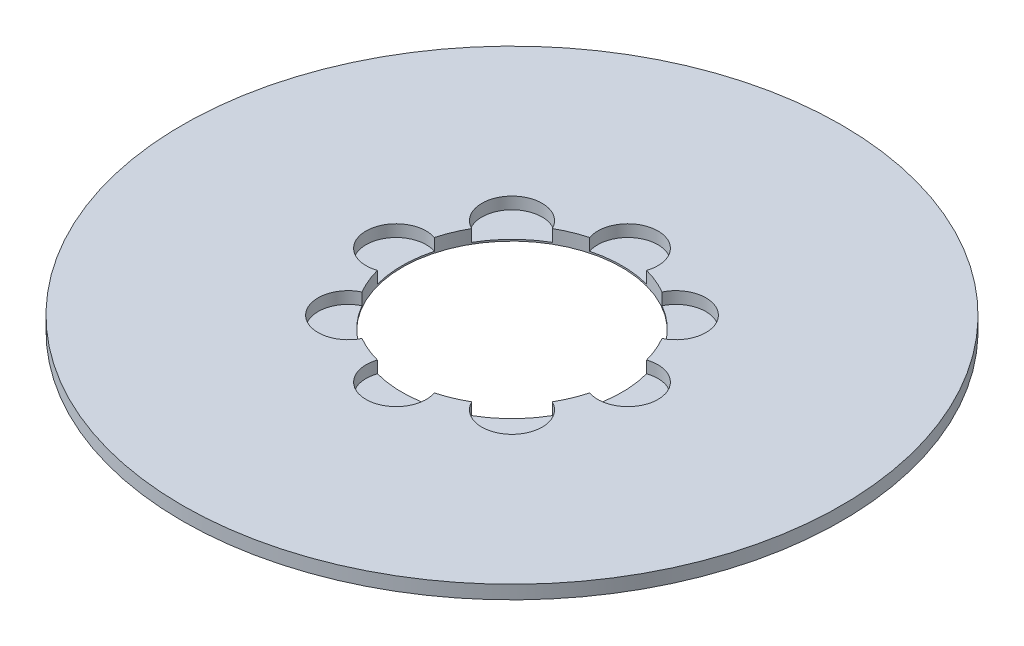
ISO-10303-21;
HEADER;
FILE_DESCRIPTION(('STEP AP214'),'2;1');
FILE_NAME('part.step','',(''),(''),'','','');
FILE_SCHEMA(('AUTOMOTIVE_DESIGN { 1 0 10303 214 1 1 1 1 }'));
ENDSEC;
DATA;
#1=APPLICATION_CONTEXT('core data for automotive mechanical design processes');
#2=APPLICATION_PROTOCOL_DEFINITION('international standard','automotive_design',2000,#1);
#3=PRODUCT_CONTEXT('',#1,'mechanical');
#4=PRODUCT('Part','Part','',(#3));
#5=PRODUCT_RELATED_PRODUCT_CATEGORY('part','',(#4));
#6=PRODUCT_DEFINITION_FORMATION('','',#4);
#7=PRODUCT_DEFINITION_CONTEXT('part definition',#1,'design');
#8=PRODUCT_DEFINITION('design','',#6,#7);
#9=PRODUCT_DEFINITION_SHAPE('','',#8);
#10=(LENGTH_UNIT() NAMED_UNIT(*) SI_UNIT(.MILLI.,.METRE.));
#11=(NAMED_UNIT(*) PLANE_ANGLE_UNIT() SI_UNIT($,.RADIAN.));
#12=(NAMED_UNIT(*) SI_UNIT($,.STERADIAN.) SOLID_ANGLE_UNIT());
#13=UNCERTAINTY_MEASURE_WITH_UNIT(LENGTH_MEASURE(1.E-05),#10,'distance_accuracy_value','');
#14=(GEOMETRIC_REPRESENTATION_CONTEXT(3) GLOBAL_UNCERTAINTY_ASSIGNED_CONTEXT((#13)) GLOBAL_UNIT_ASSIGNED_CONTEXT((#10,
#11,#12)) REPRESENTATION_CONTEXT('',''));
#15=CARTESIAN_POINT('',(0.,0.,0.));
#16=DIRECTION('',(0.,0.,1.));
#17=DIRECTION('',(1.,0.,0.));
#18=AXIS2_PLACEMENT_3D('',#15,#16,#17);
#19=CARTESIAN_POINT('',(0.,4.,0.));
#20=DIRECTION('',(0.,-1.,0.));
#21=DIRECTION('',(0.,0.,-1.));
#22=AXIS2_PLACEMENT_3D('',#19,#20,#21);
#23=CYLINDRICAL_SURFACE('',#22,97.5);
#24=CARTESIAN_POINT('',(0.,4.,0.));
#25=DIRECTION('',(0.,1.,0.));
#26=DIRECTION('',(0.,0.,1.));
#27=AXIS2_PLACEMENT_3D('',#24,#25,#26);
#28=CIRCLE('',#27,97.5);
#29=CARTESIAN_POINT('',(0.,4.,97.5));
#30=VERTEX_POINT('',#29);
#31=EDGE_CURVE('E195',#30,#30,#28,.T.);
#32=ORIENTED_EDGE('',*,*,#31,.F.);
#33=EDGE_LOOP('',(#32));
#34=FACE_BOUND('',#33,.T.);
#35=CARTESIAN_POINT('',(0.,0.,0.));
#36=DIRECTION('',(0.,1.,0.));
#37=DIRECTION('',(0.,0.,1.));
#38=AXIS2_PLACEMENT_3D('',#35,#36,#37);
#39=CIRCLE('',#38,97.5);
#40=CARTESIAN_POINT('',(0.,0.,97.5));
#41=VERTEX_POINT('',#40);
#42=EDGE_CURVE('E179',#41,#41,#39,.T.);
#43=ORIENTED_EDGE('',*,*,#42,.T.);
#44=EDGE_LOOP('',(#43));
#45=FACE_BOUND('',#44,.T.);
#46=ADVANCED_FACE('F39',(#34,#45),#23,.T.);
#47=CARTESIAN_POINT('',(0.,4.,0.));
#48=DIRECTION('',(0.,1.,0.));
#49=DIRECTION('',(0.,0.,1.));
#50=AXIS2_PLACEMENT_3D('',#47,#48,#49);
#51=PLANE('',#50);
#52=CARTESIAN_POINT('',(1.19679199415375E-13,4.,34.2774850559646));
#53=DIRECTION('',(0.,1.,0.));
#54=DIRECTION('',(1.,0.,0.));
#55=AXIS2_PLACEMENT_3D('',#52,#53,#54);
#56=CIRCLE('',#55,8.90529188802286);
#57=CARTESIAN_POINT('',(-8.42392700702646,4.,31.3892888383966));
#58=VERTEX_POINT('',#57);
#59=CARTESIAN_POINT('',(8.42392700702668,4.,31.3892888383966));
#60=VERTEX_POINT('',#59);
#61=EDGE_CURVE('E176',#58,#60,#56,.T.);
#62=ORIENTED_EDGE('',*,*,#61,.F.);
#63=CARTESIAN_POINT('',(0.,4.,0.));
#64=DIRECTION('',(0.,1.,0.));
#65=DIRECTION('',(0.,0.,1.));
#66=AXIS2_PLACEMENT_3D('',#63,#64,#65);
#67=CIRCLE('',#66,32.5);
#68=CARTESIAN_POINT('',(-16.2389630833644,4.,28.1521949051425));
#69=VERTEX_POINT('',#68);
#70=EDGE_CURVE('E166',#69,#58,#67,.T.);
#71=ORIENTED_EDGE('',*,*,#70,.F.);
#72=CARTESIAN_POINT('',(-24.2378421250931,4.,24.2378421250931));
#73=DIRECTION('',(0.,1.,0.));
#74=DIRECTION('',(0.707106781186549,0.,0.707106781186546));
#75=AXIS2_PLACEMENT_3D('',#72,#73,#74);
#76=CIRCLE('',#75,8.90529188802286);
#77=CARTESIAN_POINT('',(-28.1521949051424,4.,16.2389630833645));
#78=VERTEX_POINT('',#77);
#79=EDGE_CURVE('E147',#78,#69,#76,.T.);
#80=ORIENTED_EDGE('',*,*,#79,.F.);
#81=CARTESIAN_POINT('',(-31.3892888383966,4.,8.42392700702657));
#82=VERTEX_POINT('',#81);
#83=EDGE_CURVE('E180',#82,#78,#67,.T.);
#84=ORIENTED_EDGE('',*,*,#83,.F.);
#85=CARTESIAN_POINT('',(-34.2774850559646,4.,0.));
#86=DIRECTION('',(0.,1.,0.));
#87=DIRECTION('',(0.,0.,1.));
#88=AXIS2_PLACEMENT_3D('',#85,#86,#87);
#89=CIRCLE('',#88,8.90529188802286);
#90=CARTESIAN_POINT('',(-31.3892888383966,4.,-8.42392700702657));
#91=VERTEX_POINT('',#90);
#92=EDGE_CURVE('E186',#91,#82,#89,.T.);
#93=ORIENTED_EDGE('',*,*,#92,.F.);
#94=CARTESIAN_POINT('',(-28.1521949051426,4.,-16.2389630833641));
#95=VERTEX_POINT('',#94);
#96=EDGE_CURVE('E182',#95,#91,#67,.T.);
#97=ORIENTED_EDGE('',*,*,#96,.F.);
#98=CARTESIAN_POINT('',(-24.2378421250934,4.,-24.2378421250928));
#99=DIRECTION('',(0.,1.,0.));
#100=DIRECTION('',(-0.707106781186539,0.,0.707106781186556));
#101=AXIS2_PLACEMENT_3D('',#98,#99,#100);
#102=CIRCLE('',#101,8.90529188802286);
#103=CARTESIAN_POINT('',(-16.2389630833648,4.,-28.1521949051422));
#104=VERTEX_POINT('',#103);
#105=EDGE_CURVE('E446',#104,#95,#102,.T.);
#106=ORIENTED_EDGE('',*,*,#105,.F.);
#107=CARTESIAN_POINT('',(-8.4239270070269,4.,-31.3892888383965));
#108=VERTEX_POINT('',#107);
#109=EDGE_CURVE('E452',#108,#104,#67,.T.);
#110=ORIENTED_EDGE('',*,*,#109,.F.);
#111=CARTESIAN_POINT('',(-3.59037598246124E-13,4.,-34.2774850559646));
#112=DIRECTION('',(0.,1.,0.));
#113=DIRECTION('',(-1.,0.,0.));
#114=AXIS2_PLACEMENT_3D('',#111,#112,#113);
#115=CIRCLE('',#114,8.90529188802286);
#116=CARTESIAN_POINT('',(8.42392700702624,4.,-31.3892888383967));
#117=VERTEX_POINT('',#116);
#118=EDGE_CURVE('E477',#117,#108,#115,.T.);
#119=ORIENTED_EDGE('',*,*,#118,.F.);
#120=CARTESIAN_POINT('',(16.2389630833642,4.,-28.1521949051426));
#121=VERTEX_POINT('',#120);
#122=EDGE_CURVE('E460',#121,#117,#67,.T.);
#123=ORIENTED_EDGE('',*,*,#122,.F.);
#124=CARTESIAN_POINT('',(24.2378421250929,4.,-24.2378421250933));
#125=DIRECTION('',(0.,1.,0.));
#126=DIRECTION('',(-0.707106781186554,0.,-0.707106781186541));
#127=AXIS2_PLACEMENT_3D('',#124,#125,#126);
#128=CIRCLE('',#127,8.90529188802286);
#129=CARTESIAN_POINT('',(28.1521949051423,4.,-16.2389630833647));
#130=VERTEX_POINT('',#129);
#131=EDGE_CURVE('E464',#130,#121,#128,.T.);
#132=ORIENTED_EDGE('',*,*,#131,.F.);
#133=CARTESIAN_POINT('',(31.3892888383966,4.,-8.42392700702657));
#134=VERTEX_POINT('',#133);
#135=EDGE_CURVE('E459',#134,#130,#67,.T.);
#136=ORIENTED_EDGE('',*,*,#135,.F.);
#137=CARTESIAN_POINT('',(34.2774850559646,4.,0.));
#138=DIRECTION('',(0.,1.,0.));
#139=DIRECTION('',(0.,0.,-1.));
#140=AXIS2_PLACEMENT_3D('',#137,#138,#139);
#141=CIRCLE('',#140,8.90529188802286);
#142=CARTESIAN_POINT('',(31.3892888383966,4.,8.42392700702657));
#143=VERTEX_POINT('',#142);
#144=EDGE_CURVE('E469',#143,#134,#141,.T.);
#145=ORIENTED_EDGE('',*,*,#144,.F.);
#146=CARTESIAN_POINT('',(28.1521949051425,4.,16.2389630833643));
#147=VERTEX_POINT('',#146);
#148=EDGE_CURVE('E181',#147,#143,#67,.T.);
#149=ORIENTED_EDGE('',*,*,#148,.F.);
#150=CARTESIAN_POINT('',(24.2378421250932,4.,24.237842125093));
#151=DIRECTION('',(0.,1.,0.));
#152=DIRECTION('',(0.707106781186544,0.,-0.707106781186551));
#153=AXIS2_PLACEMENT_3D('',#150,#151,#152);
#154=CIRCLE('',#153,8.90529188802286);
#155=CARTESIAN_POINT('',(16.2389630833646,4.,28.1521949051423));
#156=VERTEX_POINT('',#155);
#157=EDGE_CURVE('E475',#156,#147,#154,.T.);
#158=ORIENTED_EDGE('',*,*,#157,.F.);
#159=EDGE_CURVE('E177',#60,#156,#67,.T.);
#160=ORIENTED_EDGE('',*,*,#159,.F.);
#161=EDGE_LOOP('',(#62,#71,#80,#84,#93,#97,#106,#110,#119,#123,#132,#136,#145,#149,#158,#160));
#162=FACE_BOUND('',#161,.T.);
#163=ORIENTED_EDGE('',*,*,#31,.T.);
#164=EDGE_LOOP('',(#163));
#165=FACE_BOUND('',#164,.T.);
#166=ADVANCED_FACE('F172',(#162,#165),#51,.T.);
#167=CARTESIAN_POINT('',(0.,0.,0.));
#168=DIRECTION('',(0.,1.,0.));
#169=DIRECTION('',(0.,0.,1.));
#170=AXIS2_PLACEMENT_3D('',#167,#168,#169);
#171=PLANE('',#170);
#172=CARTESIAN_POINT('',(0.,0.,0.));
#173=DIRECTION('',(0.,1.,0.));
#174=DIRECTION('',(0.,0.,1.));
#175=AXIS2_PLACEMENT_3D('',#172,#173,#174);
#176=CIRCLE('',#175,32.5);
#177=CARTESIAN_POINT('',(0.,0.,32.5));
#178=VERTEX_POINT('',#177);
#179=EDGE_CURVE('E187',#178,#178,#176,.T.);
#180=ORIENTED_EDGE('',*,*,#179,.T.);
#181=EDGE_LOOP('',(#180));
#182=FACE_BOUND('',#181,.T.);
#183=ORIENTED_EDGE('',*,*,#42,.F.);
#184=EDGE_LOOP('',(#183));
#185=FACE_BOUND('',#184,.T.);
#186=ADVANCED_FACE('F270',(#182,#185),#171,.F.);
#187=CARTESIAN_POINT('',(0.,4.,0.));
#188=DIRECTION('',(0.,-1.,0.));
#189=DIRECTION('',(0.,0.,-1.));
#190=AXIS2_PLACEMENT_3D('',#187,#188,#189);
#191=CYLINDRICAL_SURFACE('',#190,32.5);
#192=DIRECTION('',(0.,1.,0.));
#193=VECTOR('',#192,1.);
#194=CARTESIAN_POINT('',(-8.42392700702646,2.23433585870761,31.3892888383966));
#195=LINE('',#194,#193);
#196=CARTESIAN_POINT('',(-8.42392700702646,0.468671717415213,31.3892888383966));
#197=VERTEX_POINT('',#196);
#198=EDGE_CURVE('E11',#197,#58,#195,.T.);
#199=ORIENTED_EDGE('',*,*,#198,.F.);
#200=CARTESIAN_POINT('',(0.,0.468671717415213,0.));
#201=DIRECTION('',(0.,1.,0.));
#202=DIRECTION('',(0.,0.,1.));
#203=AXIS2_PLACEMENT_3D('',#200,#201,#202);
#204=CIRCLE('',#203,32.5);
#205=CARTESIAN_POINT('',(8.42392700702668,0.468671717415213,31.3892888383966));
#206=VERTEX_POINT('',#205);
#207=EDGE_CURVE('E250',#197,#206,#204,.T.);
#208=ORIENTED_EDGE('',*,*,#207,.T.);
#209=DIRECTION('',(0.,1.,0.));
#210=VECTOR('',#209,1.);
#211=CARTESIAN_POINT('',(8.42392700702668,2.23433585870761,31.3892888383965));
#212=LINE('',#211,#210);
#213=EDGE_CURVE('E46',#60,#206,#212,.F.);
#214=ORIENTED_EDGE('',*,*,#213,.F.);
#215=ORIENTED_EDGE('',*,*,#159,.T.);
#216=DIRECTION('',(0.,1.,0.));
#217=VECTOR('',#216,1.);
#218=CARTESIAN_POINT('',(16.2389630833646,2.23433585870761,28.1521949051423));
#219=LINE('',#218,#217);
#220=CARTESIAN_POINT('',(16.2389630833646,0.468671717415213,28.1521949051423));
#221=VERTEX_POINT('',#220);
#222=EDGE_CURVE('E244',#221,#156,#219,.T.);
#223=ORIENTED_EDGE('',*,*,#222,.F.);
#224=CARTESIAN_POINT('',(0.,0.468671717415213,0.));
#225=DIRECTION('',(0.,1.,0.));
#226=DIRECTION('',(0.,0.,1.));
#227=AXIS2_PLACEMENT_3D('',#224,#225,#226);
#228=CIRCLE('',#227,32.5);
#229=CARTESIAN_POINT('',(28.1521949051425,0.468671717415213,16.2389630833643));
#230=VERTEX_POINT('',#229);
#231=EDGE_CURVE('E238',#221,#230,#228,.T.);
#232=ORIENTED_EDGE('',*,*,#231,.T.);
#233=DIRECTION('',(0.,1.,0.));
#234=VECTOR('',#233,1.);
#235=CARTESIAN_POINT('',(28.1521949051425,2.23433585870761,16.2389630833643));
#236=LINE('',#235,#234);
#237=EDGE_CURVE('E242',#147,#230,#236,.F.);
#238=ORIENTED_EDGE('',*,*,#237,.F.);
#239=ORIENTED_EDGE('',*,*,#148,.T.);
#240=DIRECTION('',(0.,1.,0.));
#241=VECTOR('',#240,1.);
#242=CARTESIAN_POINT('',(31.3892888383966,2.23433585870761,8.42392700702657));
#243=LINE('',#242,#241);
#244=CARTESIAN_POINT('',(31.3892888383966,0.468671717415213,8.42392700702657));
#245=VERTEX_POINT('',#244);
#246=EDGE_CURVE('E236',#245,#143,#243,.T.);
#247=ORIENTED_EDGE('',*,*,#246,.F.);
#248=CARTESIAN_POINT('',(0.,0.468671717415213,0.));
#249=DIRECTION('',(0.,1.,0.));
#250=DIRECTION('',(0.,0.,1.));
#251=AXIS2_PLACEMENT_3D('',#248,#249,#250);
#252=CIRCLE('',#251,32.5);
#253=CARTESIAN_POINT('',(31.3892888383966,0.468671717415213,-8.42392700702657));
#254=VERTEX_POINT('',#253);
#255=EDGE_CURVE('E235',#245,#254,#252,.T.);
#256=ORIENTED_EDGE('',*,*,#255,.T.);
#257=DIRECTION('',(0.,1.,0.));
#258=VECTOR('',#257,1.);
#259=CARTESIAN_POINT('',(31.3892888383966,2.23433585870761,-8.42392700702657));
#260=LINE('',#259,#258);
#261=EDGE_CURVE('E234',#134,#254,#260,.F.);
#262=ORIENTED_EDGE('',*,*,#261,.F.);
#263=ORIENTED_EDGE('',*,*,#135,.T.);
#264=DIRECTION('',(0.,1.,0.));
#265=VECTOR('',#264,1.);
#266=CARTESIAN_POINT('',(28.1521949051423,2.23433585870761,-16.2389630833647));
#267=LINE('',#266,#265);
#268=CARTESIAN_POINT('',(28.1521949051423,0.468671717415213,-16.2389630833647));
#269=VERTEX_POINT('',#268);
#270=EDGE_CURVE('E229',#269,#130,#267,.T.);
#271=ORIENTED_EDGE('',*,*,#270,.F.);
#272=CARTESIAN_POINT('',(0.,0.468671717415213,0.));
#273=DIRECTION('',(0.,1.,0.));
#274=DIRECTION('',(0.,0.,1.));
#275=AXIS2_PLACEMENT_3D('',#272,#273,#274);
#276=CIRCLE('',#275,32.5);
#277=CARTESIAN_POINT('',(16.2389630833642,0.468671717415213,-28.1521949051426));
#278=VERTEX_POINT('',#277);
#279=EDGE_CURVE('E221',#269,#278,#276,.T.);
#280=ORIENTED_EDGE('',*,*,#279,.T.);
#281=DIRECTION('',(0.,1.,0.));
#282=VECTOR('',#281,1.);
#283=CARTESIAN_POINT('',(16.2389630833642,2.23433585870761,-28.1521949051426));
#284=LINE('',#283,#282);
#285=EDGE_CURVE('E230',#121,#278,#284,.F.);
#286=ORIENTED_EDGE('',*,*,#285,.F.);
#287=ORIENTED_EDGE('',*,*,#122,.T.);
#288=DIRECTION('',(0.,1.,0.));
#289=VECTOR('',#288,1.);
#290=CARTESIAN_POINT('',(8.42392700702624,2.23433585870761,-31.3892888383967));
#291=LINE('',#290,#289);
#292=CARTESIAN_POINT('',(8.42392700702624,0.468671717415213,-31.3892888383967));
#293=VERTEX_POINT('',#292);
#294=EDGE_CURVE('E225',#293,#117,#291,.T.);
#295=ORIENTED_EDGE('',*,*,#294,.F.);
#296=CARTESIAN_POINT('',(0.,0.468671717415213,0.));
#297=DIRECTION('',(0.,1.,0.));
#298=DIRECTION('',(0.,0.,1.));
#299=AXIS2_PLACEMENT_3D('',#296,#297,#298);
#300=CIRCLE('',#299,32.5);
#301=CARTESIAN_POINT('',(-8.4239270070269,0.468671717415213,-31.3892888383965));
#302=VERTEX_POINT('',#301);
#303=EDGE_CURVE('E216',#293,#302,#300,.T.);
#304=ORIENTED_EDGE('',*,*,#303,.T.);
#305=DIRECTION('',(0.,1.,0.));
#306=VECTOR('',#305,1.);
#307=CARTESIAN_POINT('',(-8.4239270070269,2.23433585870761,-31.3892888383965));
#308=LINE('',#307,#306);
#309=EDGE_CURVE('E218',#108,#302,#308,.F.);
#310=ORIENTED_EDGE('',*,*,#309,.F.);
#311=ORIENTED_EDGE('',*,*,#109,.T.);
#312=DIRECTION('',(0.,1.,0.));
#313=VECTOR('',#312,1.);
#314=CARTESIAN_POINT('',(-16.2389630833648,2.23433585870761,-28.1521949051422));
#315=LINE('',#314,#313);
#316=CARTESIAN_POINT('',(-16.2389630833648,0.468671717415213,-28.1521949051422));
#317=VERTEX_POINT('',#316);
#318=EDGE_CURVE('E212',#317,#104,#315,.T.);
#319=ORIENTED_EDGE('',*,*,#318,.F.);
#320=CARTESIAN_POINT('',(0.,0.468671717415213,0.));
#321=DIRECTION('',(0.,1.,0.));
#322=DIRECTION('',(0.,0.,1.));
#323=AXIS2_PLACEMENT_3D('',#320,#321,#322);
#324=CIRCLE('',#323,32.5);
#325=CARTESIAN_POINT('',(-28.1521949051426,0.468671717415213,-16.2389630833641));
#326=VERTEX_POINT('',#325);
#327=EDGE_CURVE('E208',#317,#326,#324,.T.);
#328=ORIENTED_EDGE('',*,*,#327,.T.);
#329=DIRECTION('',(0.,1.,0.));
#330=VECTOR('',#329,1.);
#331=CARTESIAN_POINT('',(-28.1521949051426,2.23433585870761,-16.2389630833641));
#332=LINE('',#331,#330);
#333=EDGE_CURVE('E211',#95,#326,#332,.F.);
#334=ORIENTED_EDGE('',*,*,#333,.F.);
#335=ORIENTED_EDGE('',*,*,#96,.T.);
#336=DIRECTION('',(0.,1.,0.));
#337=VECTOR('',#336,1.);
#338=CARTESIAN_POINT('',(-31.3892888383966,2.23433585870761,-8.42392700702657));
#339=LINE('',#338,#337);
#340=CARTESIAN_POINT('',(-31.3892888383966,0.468671717415213,-8.42392700702657));
#341=VERTEX_POINT('',#340);
#342=EDGE_CURVE('E201',#341,#91,#339,.T.);
#343=ORIENTED_EDGE('',*,*,#342,.F.);
#344=CARTESIAN_POINT('',(0.,0.468671717415213,0.));
#345=DIRECTION('',(0.,1.,0.));
#346=DIRECTION('',(0.,0.,1.));
#347=AXIS2_PLACEMENT_3D('',#344,#345,#346);
#348=CIRCLE('',#347,32.5);
#349=CARTESIAN_POINT('',(-31.3892888383966,0.468671717415213,8.42392700702657));
#350=VERTEX_POINT('',#349);
#351=EDGE_CURVE('E194',#341,#350,#348,.T.);
#352=ORIENTED_EDGE('',*,*,#351,.T.);
#353=DIRECTION('',(0.,1.,0.));
#354=VECTOR('',#353,1.);
#355=CARTESIAN_POINT('',(-31.3892888383966,2.23433585870761,8.42392700702657));
#356=LINE('',#355,#354);
#357=EDGE_CURVE('E199',#82,#350,#356,.F.);
#358=ORIENTED_EDGE('',*,*,#357,.F.);
#359=ORIENTED_EDGE('',*,*,#83,.T.);
#360=DIRECTION('',(0.,1.,0.));
#361=VECTOR('',#360,1.);
#362=CARTESIAN_POINT('',(-28.1521949051424,2.23433585870761,16.2389630833645));
#363=LINE('',#362,#361);
#364=CARTESIAN_POINT('',(-28.1521949051424,0.468671717415213,16.2389630833645));
#365=VERTEX_POINT('',#364);
#366=EDGE_CURVE('E160',#365,#78,#363,.T.);
#367=ORIENTED_EDGE('',*,*,#366,.F.);
#368=CARTESIAN_POINT('',(0.,0.468671717415213,0.));
#369=DIRECTION('',(0.,1.,0.));
#370=DIRECTION('',(0.,0.,1.));
#371=AXIS2_PLACEMENT_3D('',#368,#369,#370);
#372=CIRCLE('',#371,32.5);
#373=CARTESIAN_POINT('',(-16.2389630833644,0.468671717415213,28.1521949051425));
#374=VERTEX_POINT('',#373);
#375=EDGE_CURVE('E168',#365,#374,#372,.T.);
#376=ORIENTED_EDGE('',*,*,#375,.T.);
#377=DIRECTION('',(0.,1.,0.));
#378=VECTOR('',#377,1.);
#379=CARTESIAN_POINT('',(-16.2389630833644,2.23433585870761,28.1521949051424));
#380=LINE('',#379,#378);
#381=EDGE_CURVE('E152',#69,#374,#380,.F.);
#382=ORIENTED_EDGE('',*,*,#381,.F.);
#383=ORIENTED_EDGE('',*,*,#70,.T.);
#384=EDGE_LOOP('',(#199,#208,#214,#215,#223,#232,#238,#239,#247,#256,#262,#263,#271,#280,#286,
#287,#295,#304,#310,#311,#319,#328,#334,#335,#343,#352,#358,#359,#367,#376,#382,#383));
#385=FACE_BOUND('',#384,.T.);
#386=ORIENTED_EDGE('',*,*,#179,.F.);
#387=EDGE_LOOP('',(#386));
#388=FACE_BOUND('',#387,.T.);
#389=ADVANCED_FACE('F170',(#385,#388),#191,.F.);
#390=CARTESIAN_POINT('',(-34.2774850559646,0.468671717415213,0.));
#391=DIRECTION('',(0.,1.,0.));
#392=DIRECTION('',(0.,0.,1.));
#393=AXIS2_PLACEMENT_3D('',#390,#391,#392);
#394=CYLINDRICAL_SURFACE('',#393,8.90529188802286);
#395=ORIENTED_EDGE('',*,*,#342,.T.);
#396=ORIENTED_EDGE('',*,*,#92,.T.);
#397=ORIENTED_EDGE('',*,*,#357,.T.);
#398=CARTESIAN_POINT('',(-34.2774850559646,0.468671717415213,0.));
#399=DIRECTION('',(0.,1.,0.));
#400=DIRECTION('',(0.,0.,1.));
#401=AXIS2_PLACEMENT_3D('',#398,#399,#400);
#402=CIRCLE('',#401,8.90529188802286);
#403=EDGE_CURVE('E191',#341,#350,#402,.T.);
#404=ORIENTED_EDGE('',*,*,#403,.F.);
#405=EDGE_LOOP('',(#395,#396,#397,#404));
#406=FACE_BOUND('',#405,.T.);
#407=ADVANCED_FACE('F279',(#406),#394,.F.);
#408=CARTESIAN_POINT('',(-34.2774850559646,0.468671717415213,0.));
#409=DIRECTION('',(0.,1.,0.));
#410=DIRECTION('',(0.,0.,1.));
#411=AXIS2_PLACEMENT_3D('',#408,#409,#410);
#412=PLANE('',#411);
#413=ORIENTED_EDGE('',*,*,#403,.T.);
#414=ORIENTED_EDGE('',*,*,#351,.F.);
#415=EDGE_LOOP('',(#413,#414));
#416=FACE_BOUND('',#415,.T.);
#417=ADVANCED_FACE('F285',(#416),#412,.T.);
#418=CARTESIAN_POINT('',(-24.2378421250931,0.468671717415213,24.2378421250931));
#419=DIRECTION('',(0.,1.,0.));
#420=DIRECTION('',(0.,0.,1.));
#421=AXIS2_PLACEMENT_3D('',#418,#419,#420);
#422=CYLINDRICAL_SURFACE('',#421,8.90529188802286);
#423=ORIENTED_EDGE('',*,*,#366,.T.);
#424=ORIENTED_EDGE('',*,*,#79,.T.);
#425=ORIENTED_EDGE('',*,*,#381,.T.);
#426=CARTESIAN_POINT('',(-24.2378421250931,0.468671717415213,24.2378421250931));
#427=DIRECTION('',(0.,1.,0.));
#428=DIRECTION('',(0.707106781186549,0.,0.707106781186546));
#429=AXIS2_PLACEMENT_3D('',#426,#427,#428);
#430=CIRCLE('',#429,8.90529188802286);
#431=EDGE_CURVE('E165',#365,#374,#430,.T.);
#432=ORIENTED_EDGE('',*,*,#431,.F.);
#433=EDGE_LOOP('',(#423,#424,#425,#432));
#434=FACE_BOUND('',#433,.T.);
#435=ADVANCED_FACE('F155',(#434),#422,.F.);
#436=CARTESIAN_POINT('',(-24.2378421250931,0.468671717415213,24.2378421250931));
#437=DIRECTION('',(0.,1.,0.));
#438=DIRECTION('',(0.707106781186549,0.,0.707106781186546));
#439=AXIS2_PLACEMENT_3D('',#436,#437,#438);
#440=PLANE('',#439);
#441=ORIENTED_EDGE('',*,*,#431,.T.);
#442=ORIENTED_EDGE('',*,*,#375,.F.);
#443=EDGE_LOOP('',(#441,#442));
#444=FACE_BOUND('',#443,.T.);
#445=ADVANCED_FACE('F288',(#444),#440,.T.);
#446=CARTESIAN_POINT('',(-24.2378421250934,0.468671717415213,-24.2378421250928));
#447=DIRECTION('',(0.,1.,0.));
#448=DIRECTION('',(0.,0.,1.));
#449=AXIS2_PLACEMENT_3D('',#446,#447,#448);
#450=CYLINDRICAL_SURFACE('',#449,8.90529188802286);
#451=ORIENTED_EDGE('',*,*,#318,.T.);
#452=ORIENTED_EDGE('',*,*,#105,.T.);
#453=ORIENTED_EDGE('',*,*,#333,.T.);
#454=CARTESIAN_POINT('',(-24.2378421250934,0.468671717415213,-24.2378421250928));
#455=DIRECTION('',(0.,1.,0.));
#456=DIRECTION('',(-0.707106781186539,0.,0.707106781186556));
#457=AXIS2_PLACEMENT_3D('',#454,#455,#456);
#458=CIRCLE('',#457,8.90529188802286);
#459=EDGE_CURVE('E447',#317,#326,#458,.T.);
#460=ORIENTED_EDGE('',*,*,#459,.F.);
#461=EDGE_LOOP('',(#451,#452,#453,#460));
#462=FACE_BOUND('',#461,.T.);
#463=ADVANCED_FACE('F295',(#462),#450,.F.);
#464=CARTESIAN_POINT('',(-24.2378421250934,0.468671717415213,-24.2378421250928));
#465=DIRECTION('',(0.,1.,0.));
#466=DIRECTION('',(-0.707106781186539,0.,0.707106781186556));
#467=AXIS2_PLACEMENT_3D('',#464,#465,#466);
#468=PLANE('',#467);
#469=ORIENTED_EDGE('',*,*,#459,.T.);
#470=ORIENTED_EDGE('',*,*,#327,.F.);
#471=EDGE_LOOP('',(#469,#470));
#472=FACE_BOUND('',#471,.T.);
#473=ADVANCED_FACE('F375',(#472),#468,.T.);
#474=CARTESIAN_POINT('',(-3.59037598246124E-13,0.468671717415213,-34.2774850559646));
#475=DIRECTION('',(0.,1.,0.));
#476=DIRECTION('',(0.,0.,1.));
#477=AXIS2_PLACEMENT_3D('',#474,#475,#476);
#478=CYLINDRICAL_SURFACE('',#477,8.90529188802286);
#479=ORIENTED_EDGE('',*,*,#294,.T.);
#480=ORIENTED_EDGE('',*,*,#118,.T.);
#481=ORIENTED_EDGE('',*,*,#309,.T.);
#482=CARTESIAN_POINT('',(-3.59037598246124E-13,0.468671717415213,-34.2774850559646));
#483=DIRECTION('',(0.,1.,0.));
#484=DIRECTION('',(-1.,0.,0.));
#485=AXIS2_PLACEMENT_3D('',#482,#483,#484);
#486=CIRCLE('',#485,8.90529188802286);
#487=EDGE_CURVE('E467',#293,#302,#486,.T.);
#488=ORIENTED_EDGE('',*,*,#487,.F.);
#489=EDGE_LOOP('',(#479,#480,#481,#488));
#490=FACE_BOUND('',#489,.T.);
#491=ADVANCED_FACE('F361',(#490),#478,.F.);
#492=CARTESIAN_POINT('',(-3.59037598246124E-13,0.468671717415213,-34.2774850559646));
#493=DIRECTION('',(0.,1.,0.));
#494=DIRECTION('',(-1.,0.,0.));
#495=AXIS2_PLACEMENT_3D('',#492,#493,#494);
#496=PLANE('',#495);
#497=ORIENTED_EDGE('',*,*,#487,.T.);
#498=ORIENTED_EDGE('',*,*,#303,.F.);
#499=EDGE_LOOP('',(#497,#498));
#500=FACE_BOUND('',#499,.T.);
#501=ADVANCED_FACE('F297',(#500),#496,.T.);
#502=CARTESIAN_POINT('',(24.2378421250929,0.468671717415213,-24.2378421250933));
#503=DIRECTION('',(0.,1.,0.));
#504=DIRECTION('',(0.,0.,1.));
#505=AXIS2_PLACEMENT_3D('',#502,#503,#504);
#506=CYLINDRICAL_SURFACE('',#505,8.90529188802286);
#507=ORIENTED_EDGE('',*,*,#270,.T.);
#508=ORIENTED_EDGE('',*,*,#131,.T.);
#509=ORIENTED_EDGE('',*,*,#285,.T.);
#510=CARTESIAN_POINT('',(24.2378421250929,0.468671717415213,-24.2378421250933));
#511=DIRECTION('',(0.,1.,0.));
#512=DIRECTION('',(-0.707106781186554,0.,-0.707106781186541));
#513=AXIS2_PLACEMENT_3D('',#510,#511,#512);
#514=CIRCLE('',#513,8.90529188802286);
#515=EDGE_CURVE('E470',#269,#278,#514,.T.);
#516=ORIENTED_EDGE('',*,*,#515,.F.);
#517=EDGE_LOOP('',(#507,#508,#509,#516));
#518=FACE_BOUND('',#517,.T.);
#519=ADVANCED_FACE('F294',(#518),#506,.F.);
#520=CARTESIAN_POINT('',(24.2378421250929,0.468671717415213,-24.2378421250933));
#521=DIRECTION('',(0.,1.,0.));
#522=DIRECTION('',(-0.707106781186554,0.,-0.707106781186541));
#523=AXIS2_PLACEMENT_3D('',#520,#521,#522);
#524=PLANE('',#523);
#525=ORIENTED_EDGE('',*,*,#515,.T.);
#526=ORIENTED_EDGE('',*,*,#279,.F.);
#527=EDGE_LOOP('',(#525,#526));
#528=FACE_BOUND('',#527,.T.);
#529=ADVANCED_FACE('F300',(#528),#524,.T.);
#530=CARTESIAN_POINT('',(34.2774850559646,0.468671717415213,0.));
#531=DIRECTION('',(0.,1.,0.));
#532=DIRECTION('',(0.,0.,1.));
#533=AXIS2_PLACEMENT_3D('',#530,#531,#532);
#534=CYLINDRICAL_SURFACE('',#533,8.90529188802286);
#535=ORIENTED_EDGE('',*,*,#246,.T.);
#536=ORIENTED_EDGE('',*,*,#144,.T.);
#537=ORIENTED_EDGE('',*,*,#261,.T.);
#538=CARTESIAN_POINT('',(34.2774850559646,0.468671717415213,0.));
#539=DIRECTION('',(0.,1.,0.));
#540=DIRECTION('',(0.,0.,-1.));
#541=AXIS2_PLACEMENT_3D('',#538,#539,#540);
#542=CIRCLE('',#541,8.90529188802286);
#543=EDGE_CURVE('E472',#245,#254,#542,.T.);
#544=ORIENTED_EDGE('',*,*,#543,.F.);
#545=EDGE_LOOP('',(#535,#536,#537,#544));
#546=FACE_BOUND('',#545,.T.);
#547=ADVANCED_FACE('F305',(#546),#534,.F.);
#548=CARTESIAN_POINT('',(34.2774850559646,0.468671717415213,0.));
#549=DIRECTION('',(0.,1.,0.));
#550=DIRECTION('',(0.,0.,-1.));
#551=AXIS2_PLACEMENT_3D('',#548,#549,#550);
#552=PLANE('',#551);
#553=ORIENTED_EDGE('',*,*,#543,.T.);
#554=ORIENTED_EDGE('',*,*,#255,.F.);
#555=EDGE_LOOP('',(#553,#554));
#556=FACE_BOUND('',#555,.T.);
#557=ADVANCED_FACE('F308',(#556),#552,.T.);
#558=CARTESIAN_POINT('',(24.2378421250932,0.468671717415213,24.237842125093));
#559=DIRECTION('',(0.,1.,0.));
#560=DIRECTION('',(0.,0.,1.));
#561=AXIS2_PLACEMENT_3D('',#558,#559,#560);
#562=CYLINDRICAL_SURFACE('',#561,8.90529188802286);
#563=ORIENTED_EDGE('',*,*,#222,.T.);
#564=ORIENTED_EDGE('',*,*,#157,.T.);
#565=ORIENTED_EDGE('',*,*,#237,.T.);
#566=CARTESIAN_POINT('',(24.2378421250932,0.468671717415213,24.237842125093));
#567=DIRECTION('',(0.,1.,0.));
#568=DIRECTION('',(0.707106781186544,0.,-0.707106781186551));
#569=AXIS2_PLACEMENT_3D('',#566,#567,#568);
#570=CIRCLE('',#569,8.90529188802286);
#571=EDGE_CURVE('E56',#221,#230,#570,.T.);
#572=ORIENTED_EDGE('',*,*,#571,.F.);
#573=EDGE_LOOP('',(#563,#564,#565,#572));
#574=FACE_BOUND('',#573,.T.);
#575=ADVANCED_FACE('F309',(#574),#562,.F.);
#576=CARTESIAN_POINT('',(24.2378421250932,0.468671717415213,24.237842125093));
#577=DIRECTION('',(0.,1.,0.));
#578=DIRECTION('',(0.707106781186544,0.,-0.707106781186551));
#579=AXIS2_PLACEMENT_3D('',#576,#577,#578);
#580=PLANE('',#579);
#581=ORIENTED_EDGE('',*,*,#571,.T.);
#582=ORIENTED_EDGE('',*,*,#231,.F.);
#583=EDGE_LOOP('',(#581,#582));
#584=FACE_BOUND('',#583,.T.);
#585=ADVANCED_FACE('F256',(#584),#580,.T.);
#586=CARTESIAN_POINT('',(1.19679199415375E-13,0.468671717415213,34.2774850559646));
#587=DIRECTION('',(0.,1.,0.));
#588=DIRECTION('',(0.,0.,1.));
#589=AXIS2_PLACEMENT_3D('',#586,#587,#588);
#590=CYLINDRICAL_SURFACE('',#589,8.90529188802286);
#591=ORIENTED_EDGE('',*,*,#198,.T.);
#592=ORIENTED_EDGE('',*,*,#61,.T.);
#593=ORIENTED_EDGE('',*,*,#213,.T.);
#594=CARTESIAN_POINT('',(1.19679199415375E-13,0.468671717415213,34.2774850559646));
#595=DIRECTION('',(0.,1.,0.));
#596=DIRECTION('',(1.,0.,0.));
#597=AXIS2_PLACEMENT_3D('',#594,#595,#596);
#598=CIRCLE('',#597,8.90529188802286);
#599=EDGE_CURVE('E55',#197,#206,#598,.T.);
#600=ORIENTED_EDGE('',*,*,#599,.F.);
#601=EDGE_LOOP('',(#591,#592,#593,#600));
#602=FACE_BOUND('',#601,.T.);
#603=ADVANCED_FACE('F253',(#602),#590,.F.);
#604=CARTESIAN_POINT('',(1.19679199415375E-13,0.468671717415213,34.2774850559646));
#605=DIRECTION('',(0.,1.,0.));
#606=DIRECTION('',(1.,0.,0.));
#607=AXIS2_PLACEMENT_3D('',#604,#605,#606);
#608=PLANE('',#607);
#609=ORIENTED_EDGE('',*,*,#599,.T.);
#610=ORIENTED_EDGE('',*,*,#207,.F.);
#611=EDGE_LOOP('',(#609,#610));
#612=FACE_BOUND('',#611,.T.);
#613=ADVANCED_FACE('F252',(#612),#608,.T.);
#614=CLOSED_SHELL('',(#46,#166,#186,#389,#407,#417,#435,#445,#463,#473,#491,#501,#519,#529,#547,
#557,#575,#585,#603,#613));
#615=MANIFOLD_SOLID_BREP('B2',#614);
#616=ADVANCED_BREP_SHAPE_REPRESENTATION('',(#18,#615),#14);
#617=SHAPE_DEFINITION_REPRESENTATION(#9,#616);
ENDSEC;
END-ISO-10303-21;
